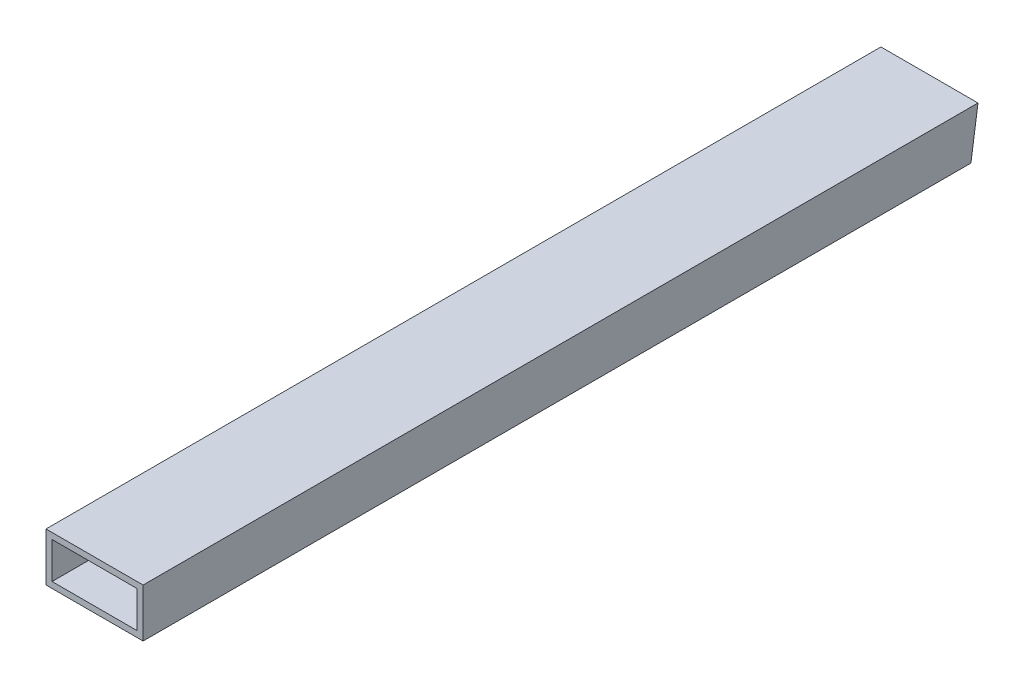
ISO-10303-21;
HEADER;
FILE_DESCRIPTION(('STEP AP214'),'2;1');
FILE_NAME('part.step','',(''),(''),'','','');
FILE_SCHEMA(('AUTOMOTIVE_DESIGN { 1 0 10303 214 1 1 1 1 }'));
ENDSEC;
DATA;
#1=APPLICATION_CONTEXT('core data for automotive mechanical design processes');
#2=APPLICATION_PROTOCOL_DEFINITION('international standard','automotive_design',2000,#1);
#3=PRODUCT_CONTEXT('',#1,'mechanical');
#4=PRODUCT('Part','Part','',(#3));
#5=PRODUCT_RELATED_PRODUCT_CATEGORY('part','',(#4));
#6=PRODUCT_DEFINITION_FORMATION('','',#4);
#7=PRODUCT_DEFINITION_CONTEXT('part definition',#1,'design');
#8=PRODUCT_DEFINITION('design','',#6,#7);
#9=PRODUCT_DEFINITION_SHAPE('','',#8);
#10=(LENGTH_UNIT() NAMED_UNIT(*) SI_UNIT(.MILLI.,.METRE.));
#11=(NAMED_UNIT(*) PLANE_ANGLE_UNIT() SI_UNIT($,.RADIAN.));
#12=(NAMED_UNIT(*) SI_UNIT($,.STERADIAN.) SOLID_ANGLE_UNIT());
#13=UNCERTAINTY_MEASURE_WITH_UNIT(LENGTH_MEASURE(1.E-05),#10,'distance_accuracy_value','');
#14=(GEOMETRIC_REPRESENTATION_CONTEXT(3) GLOBAL_UNCERTAINTY_ASSIGNED_CONTEXT((#13)) GLOBAL_UNIT_ASSIGNED_CONTEXT((#10,
#11,#12)) REPRESENTATION_CONTEXT('',''));
#15=CARTESIAN_POINT('',(0.,0.,0.));
#16=DIRECTION('',(0.,0.,1.));
#17=DIRECTION('',(1.,0.,0.));
#18=AXIS2_PLACEMENT_3D('',#15,#16,#17);
#19=CARTESIAN_POINT('',(-18.5952664732653,-5.32081349060378,0.));
#20=DIRECTION('',(-1.,0.,0.));
#21=DIRECTION('',(0.,0.,1.));
#22=AXIS2_PLACEMENT_3D('',#19,#20,#21);
#23=PLANE('',#22);
#24=DIRECTION('',(0.,-0.989525789068969,0.144356201000973));
#25=VECTOR('',#24,1.);
#26=CARTESIAN_POINT('',(-18.5952664732653,7.5122089882203,1.83332375271237));
#27=LINE('',#26,#25);
#28=CARTESIAN_POINT('',(-18.5952664732653,-2.14581349060378,3.24227685896422));
#29=VERTEX_POINT('',#28);
#30=CARTESIAN_POINT('',(-18.5952664732653,16.9041865093962,0.463182408423466));
#31=VERTEX_POINT('',#30);
#32=EDGE_CURVE('E105',#29,#31,#27,.F.);
#33=ORIENTED_EDGE('',*,*,#32,.T.);
#34=DIRECTION('',(0.,0.,1.));
#35=VECTOR('',#34,1.);
#36=CARTESIAN_POINT('',(-18.5952664732653,16.9041865093962,0.));
#37=LINE('',#36,#35);
#38=CARTESIAN_POINT('',(-18.5952664732653,16.9041865093962,436.88));
#39=VERTEX_POINT('',#38);
#40=EDGE_CURVE('E20',#31,#39,#37,.T.);
#41=ORIENTED_EDGE('',*,*,#40,.T.);
#42=DIRECTION('',(0.,1.,0.));
#43=VECTOR('',#42,1.);
#44=CARTESIAN_POINT('',(-18.5952664732653,7.37918650939622,436.88));
#45=LINE('',#44,#43);
#46=CARTESIAN_POINT('',(-18.5952664732653,-2.14581349060378,436.88));
#47=VERTEX_POINT('',#46);
#48=EDGE_CURVE('E117',#47,#39,#45,.T.);
#49=ORIENTED_EDGE('',*,*,#48,.F.);
#50=DIRECTION('',(0.,0.,-1.));
#51=VECTOR('',#50,1.);
#52=CARTESIAN_POINT('',(-18.5952664732653,-2.14581349060378,0.));
#53=LINE('',#52,#51);
#54=EDGE_CURVE('E101',#47,#29,#53,.T.);
#55=ORIENTED_EDGE('',*,*,#54,.T.);
#56=EDGE_LOOP('',(#33,#41,#49,#55));
#57=FACE_BOUND('',#56,.T.);
#58=ADVANCED_FACE('F17',(#57),#23,.F.);
#59=CARTESIAN_POINT('',(-21.7702664732653,16.9041865093962,0.));
#60=DIRECTION('',(0.,1.,0.));
#61=DIRECTION('',(0.,0.,1.));
#62=AXIS2_PLACEMENT_3D('',#59,#60,#61);
#63=PLANE('',#62);
#64=DIRECTION('',(1.,0.,0.));
#65=VECTOR('',#64,1.);
#66=CARTESIAN_POINT('',(3.62973352673468,16.9041865093962,0.463182408423473));
#67=LINE('',#66,#65);
#68=CARTESIAN_POINT('',(25.8547335267346,16.9041865093962,0.463182408423471));
#69=VERTEX_POINT('',#68);
#70=EDGE_CURVE('E107',#31,#69,#67,.T.);
#71=ORIENTED_EDGE('',*,*,#70,.T.);
#72=DIRECTION('',(0.,0.,-1.));
#73=VECTOR('',#72,1.);
#74=CARTESIAN_POINT('',(25.8547335267346,16.9041865093962,0.));
#75=LINE('',#74,#73);
#76=CARTESIAN_POINT('',(25.8547335267346,16.9041865093962,436.88));
#77=VERTEX_POINT('',#76);
#78=EDGE_CURVE('E79',#69,#77,#75,.F.);
#79=ORIENTED_EDGE('',*,*,#78,.T.);
#80=DIRECTION('',(1.,0.,0.));
#81=VECTOR('',#80,1.);
#82=CARTESIAN_POINT('',(3.62973352673468,16.9041865093962,436.88));
#83=LINE('',#82,#81);
#84=EDGE_CURVE('E119',#39,#77,#83,.T.);
#85=ORIENTED_EDGE('',*,*,#84,.F.);
#86=ORIENTED_EDGE('',*,*,#40,.F.);
#87=EDGE_LOOP('',(#71,#79,#85,#86));
#88=FACE_BOUND('',#87,.T.);
#89=ADVANCED_FACE('F120',(#88),#63,.F.);
#90=CARTESIAN_POINT('',(25.8547335267346,20.0791865093962,0.));
#91=DIRECTION('',(1.,0.,0.));
#92=DIRECTION('',(0.,0.,-1.));
#93=AXIS2_PLACEMENT_3D('',#90,#91,#92);
#94=PLANE('',#93);
#95=DIRECTION('',(0.,-0.989525789068969,0.144356201000973));
#96=VECTOR('',#95,1.);
#97=CARTESIAN_POINT('',(25.8547335267346,7.5122089882203,1.83332375271237));
#98=LINE('',#97,#96);
#99=CARTESIAN_POINT('',(25.8547335267346,-2.14581349060378,3.24227685896422));
#100=VERTEX_POINT('',#99);
#101=EDGE_CURVE('E82',#69,#100,#98,.T.);
#102=ORIENTED_EDGE('',*,*,#101,.T.);
#103=DIRECTION('',(0.,0.,-1.));
#104=VECTOR('',#103,1.);
#105=CARTESIAN_POINT('',(25.8547335267346,-2.14581349060378,0.));
#106=LINE('',#105,#104);
#107=CARTESIAN_POINT('',(25.8547335267346,-2.14581349060378,436.88));
#108=VERTEX_POINT('',#107);
#109=EDGE_CURVE('E85',#100,#108,#106,.F.);
#110=ORIENTED_EDGE('',*,*,#109,.T.);
#111=DIRECTION('',(0.,1.,0.));
#112=VECTOR('',#111,1.);
#113=CARTESIAN_POINT('',(25.8547335267346,7.37918650939622,436.88));
#114=LINE('',#113,#112);
#115=EDGE_CURVE('E122',#77,#108,#114,.F.);
#116=ORIENTED_EDGE('',*,*,#115,.F.);
#117=ORIENTED_EDGE('',*,*,#78,.F.);
#118=EDGE_LOOP('',(#102,#110,#116,#117));
#119=FACE_BOUND('',#118,.T.);
#120=ADVANCED_FACE('F84',(#119),#94,.F.);
#121=CARTESIAN_POINT('',(29.0297335267346,-2.14581349060378,0.));
#122=DIRECTION('',(0.,-1.,0.));
#123=DIRECTION('',(0.,0.,-1.));
#124=AXIS2_PLACEMENT_3D('',#121,#122,#123);
#125=PLANE('',#124);
#126=DIRECTION('',(1.,0.,0.));
#127=VECTOR('',#126,1.);
#128=CARTESIAN_POINT('',(3.62973352673468,-2.14581349060378,3.24227685896423));
#129=LINE('',#128,#127);
#130=EDGE_CURVE('E90',#100,#29,#129,.F.);
#131=ORIENTED_EDGE('',*,*,#130,.T.);
#132=ORIENTED_EDGE('',*,*,#54,.F.);
#133=DIRECTION('',(1.,0.,0.));
#134=VECTOR('',#133,1.);
#135=CARTESIAN_POINT('',(3.62973352673468,-2.14581349060378,436.88));
#136=LINE('',#135,#134);
#137=EDGE_CURVE('E99',#108,#47,#136,.F.);
#138=ORIENTED_EDGE('',*,*,#137,.F.);
#139=ORIENTED_EDGE('',*,*,#109,.F.);
#140=EDGE_LOOP('',(#131,#132,#138,#139));
#141=FACE_BOUND('',#140,.T.);
#142=ADVANCED_FACE('F95',(#141),#125,.F.);
#143=CARTESIAN_POINT('',(29.0297335267346,-5.32081349060378,0.));
#144=DIRECTION('',(0.,-1.,0.));
#145=DIRECTION('',(0.,0.,-1.));
#146=AXIS2_PLACEMENT_3D('',#143,#144,#145);
#147=PLANE('',#146);
#148=DIRECTION('',(1.,0.,0.));
#149=VECTOR('',#148,1.);
#150=CARTESIAN_POINT('',(3.62973352673468,-5.32081349060378,436.88));
#151=LINE('',#150,#149);
#152=CARTESIAN_POINT('',(-21.7702664732653,-5.32081349060378,436.88));
#153=VERTEX_POINT('',#152);
#154=CARTESIAN_POINT('',(29.0297335267346,-5.32081349060378,436.88));
#155=VERTEX_POINT('',#154);
#156=EDGE_CURVE('E125',#153,#155,#151,.T.);
#157=ORIENTED_EDGE('',*,*,#156,.F.);
#158=DIRECTION('',(0.,0.,1.));
#159=VECTOR('',#158,1.);
#160=CARTESIAN_POINT('',(-21.7702664732653,-5.32081349060378,0.));
#161=LINE('',#160,#159);
#162=CARTESIAN_POINT('',(-21.7702664732653,-5.32081349060378,3.70545926738768));
#163=VERTEX_POINT('',#162);
#164=EDGE_CURVE('E133',#163,#153,#161,.T.);
#165=ORIENTED_EDGE('',*,*,#164,.F.);
#166=DIRECTION('',(1.,0.,0.));
#167=VECTOR('',#166,1.);
#168=CARTESIAN_POINT('',(3.62973352673468,-5.32081349060378,3.70545926738769));
#169=LINE('',#168,#167);
#170=CARTESIAN_POINT('',(29.0297335267346,-5.32081349060378,3.70545926738768));
#171=VERTEX_POINT('',#170);
#172=EDGE_CURVE('E91',#163,#171,#169,.T.);
#173=ORIENTED_EDGE('',*,*,#172,.T.);
#174=DIRECTION('',(0.,0.,-1.));
#175=VECTOR('',#174,1.);
#176=CARTESIAN_POINT('',(29.0297335267346,-5.32081349060378,0.));
#177=LINE('',#176,#175);
#178=EDGE_CURVE('E153',#155,#171,#177,.T.);
#179=ORIENTED_EDGE('',*,*,#178,.F.);
#180=EDGE_LOOP('',(#157,#165,#173,#179));
#181=FACE_BOUND('',#180,.T.);
#182=ADVANCED_FACE('F152',(#181),#147,.T.);
#183=CARTESIAN_POINT('',(3.62973352673468,7.5122089882203,1.83332375271237));
#184=DIRECTION('',(0.,0.144356201000973,0.989525789068969));
#185=DIRECTION('',(0.,-0.989525789068969,0.144356201000973));
#186=AXIS2_PLACEMENT_3D('',#183,#184,#185);
#187=PLANE('',#186);
#188=ORIENTED_EDGE('',*,*,#32,.F.);
#189=ORIENTED_EDGE('',*,*,#130,.F.);
#190=ORIENTED_EDGE('',*,*,#101,.F.);
#191=ORIENTED_EDGE('',*,*,#70,.F.);
#192=EDGE_LOOP('',(#188,#189,#190,#191));
#193=FACE_BOUND('',#192,.T.);
#194=ORIENTED_EDGE('',*,*,#172,.F.);
#195=DIRECTION('',(0.,-0.989525789068969,0.144356201000973));
#196=VECTOR('',#195,1.);
#197=CARTESIAN_POINT('',(-21.7702664732653,20.0791865093962,0.));
#198=LINE('',#197,#196);
#199=CARTESIAN_POINT('',(-21.7702664732653,20.0791865093962,0.));
#200=VERTEX_POINT('',#199);
#201=EDGE_CURVE('E135',#200,#163,#198,.T.);
#202=ORIENTED_EDGE('',*,*,#201,.F.);
#203=DIRECTION('',(1.,0.,0.));
#204=VECTOR('',#203,1.);
#205=CARTESIAN_POINT('',(-21.7702664732653,20.0791865093962,0.));
#206=LINE('',#205,#204);
#207=CARTESIAN_POINT('',(29.0297335267346,20.0791865093962,0.));
#208=VERTEX_POINT('',#207);
#209=EDGE_CURVE('E146',#208,#200,#206,.F.);
#210=ORIENTED_EDGE('',*,*,#209,.F.);
#211=DIRECTION('',(0.,0.989525789068969,-0.144356201000973));
#212=VECTOR('',#211,1.);
#213=CARTESIAN_POINT('',(29.0297335267346,-5.32081349060378,3.70545926738768));
#214=LINE('',#213,#212);
#215=EDGE_CURVE('E148',#171,#208,#214,.T.);
#216=ORIENTED_EDGE('',*,*,#215,.F.);
#217=EDGE_LOOP('',(#194,#202,#210,#216));
#218=FACE_BOUND('',#217,.T.);
#219=ADVANCED_FACE('F103',(#193,#218),#187,.F.);
#220=CARTESIAN_POINT('',(-21.7702664732653,-5.32081349060378,0.));
#221=DIRECTION('',(-1.,0.,0.));
#222=DIRECTION('',(0.,0.,1.));
#223=AXIS2_PLACEMENT_3D('',#220,#221,#222);
#224=PLANE('',#223);
#225=DIRECTION('',(0.,1.,0.));
#226=VECTOR('',#225,1.);
#227=CARTESIAN_POINT('',(-21.7702664732653,7.37918650939622,436.88));
#228=LINE('',#227,#226);
#229=CARTESIAN_POINT('',(-21.7702664732653,20.0791865093962,436.88));
#230=VERTEX_POINT('',#229);
#231=EDGE_CURVE('E127',#230,#153,#228,.F.);
#232=ORIENTED_EDGE('',*,*,#231,.F.);
#233=DIRECTION('',(0.,0.,1.));
#234=VECTOR('',#233,1.);
#235=CARTESIAN_POINT('',(-21.7702664732653,20.0791865093962,0.));
#236=LINE('',#235,#234);
#237=EDGE_CURVE('E143',#200,#230,#236,.T.);
#238=ORIENTED_EDGE('',*,*,#237,.F.);
#239=ORIENTED_EDGE('',*,*,#201,.T.);
#240=ORIENTED_EDGE('',*,*,#164,.T.);
#241=EDGE_LOOP('',(#232,#238,#239,#240));
#242=FACE_BOUND('',#241,.T.);
#243=ADVANCED_FACE('F139',(#242),#224,.T.);
#244=CARTESIAN_POINT('',(3.62973352673468,7.37918650939622,436.88));
#245=DIRECTION('',(0.,0.,1.));
#246=DIRECTION('',(1.,0.,0.));
#247=AXIS2_PLACEMENT_3D('',#244,#245,#246);
#248=PLANE('',#247);
#249=ORIENTED_EDGE('',*,*,#115,.T.);
#250=ORIENTED_EDGE('',*,*,#137,.T.);
#251=ORIENTED_EDGE('',*,*,#48,.T.);
#252=ORIENTED_EDGE('',*,*,#84,.T.);
#253=EDGE_LOOP('',(#249,#250,#251,#252));
#254=FACE_BOUND('',#253,.T.);
#255=DIRECTION('',(0.,1.,0.));
#256=VECTOR('',#255,1.);
#257=CARTESIAN_POINT('',(29.0297335267346,20.0791865093962,436.88));
#258=LINE('',#257,#256);
#259=CARTESIAN_POINT('',(29.0297335267346,20.0791865093962,436.88));
#260=VERTEX_POINT('',#259);
#261=EDGE_CURVE('E35',#260,#155,#258,.F.);
#262=ORIENTED_EDGE('',*,*,#261,.F.);
#263=DIRECTION('',(1.,0.,0.));
#264=VECTOR('',#263,1.);
#265=CARTESIAN_POINT('',(-21.7702664732653,20.0791865093962,436.88));
#266=LINE('',#265,#264);
#267=EDGE_CURVE('E26',#230,#260,#266,.T.);
#268=ORIENTED_EDGE('',*,*,#267,.F.);
#269=ORIENTED_EDGE('',*,*,#231,.T.);
#270=ORIENTED_EDGE('',*,*,#156,.T.);
#271=EDGE_LOOP('',(#262,#268,#269,#270));
#272=FACE_BOUND('',#271,.T.);
#273=ADVANCED_FACE('F124',(#254,#272),#248,.T.);
#274=CARTESIAN_POINT('',(29.0297335267346,20.0791865093962,0.));
#275=DIRECTION('',(1.,0.,0.));
#276=DIRECTION('',(0.,0.,-1.));
#277=AXIS2_PLACEMENT_3D('',#274,#275,#276);
#278=PLANE('',#277);
#279=ORIENTED_EDGE('',*,*,#261,.T.);
#280=ORIENTED_EDGE('',*,*,#178,.T.);
#281=ORIENTED_EDGE('',*,*,#215,.T.);
#282=DIRECTION('',(0.,0.,1.));
#283=VECTOR('',#282,1.);
#284=CARTESIAN_POINT('',(29.0297335267346,20.0791865093962,0.));
#285=LINE('',#284,#283);
#286=EDGE_CURVE('E11',#260,#208,#285,.F.);
#287=ORIENTED_EDGE('',*,*,#286,.F.);
#288=EDGE_LOOP('',(#279,#280,#281,#287));
#289=FACE_BOUND('',#288,.T.);
#290=ADVANCED_FACE('F165',(#289),#278,.T.);
#291=CARTESIAN_POINT('',(-21.7702664732653,20.0791865093962,0.));
#292=DIRECTION('',(0.,1.,0.));
#293=DIRECTION('',(0.,0.,1.));
#294=AXIS2_PLACEMENT_3D('',#291,#292,#293);
#295=PLANE('',#294);
#296=ORIENTED_EDGE('',*,*,#267,.T.);
#297=ORIENTED_EDGE('',*,*,#286,.T.);
#298=ORIENTED_EDGE('',*,*,#209,.T.);
#299=ORIENTED_EDGE('',*,*,#237,.T.);
#300=EDGE_LOOP('',(#296,#297,#298,#299));
#301=FACE_BOUND('',#300,.T.);
#302=ADVANCED_FACE('F157',(#301),#295,.T.);
#303=CLOSED_SHELL('',(#58,#89,#120,#142,#182,#219,#243,#273,#290,#302));
#304=MANIFOLD_SOLID_BREP('B1',#303);
#305=ADVANCED_BREP_SHAPE_REPRESENTATION('',(#18,#304),#14);
#306=SHAPE_DEFINITION_REPRESENTATION(#9,#305);
ENDSEC;
END-ISO-10303-21;
